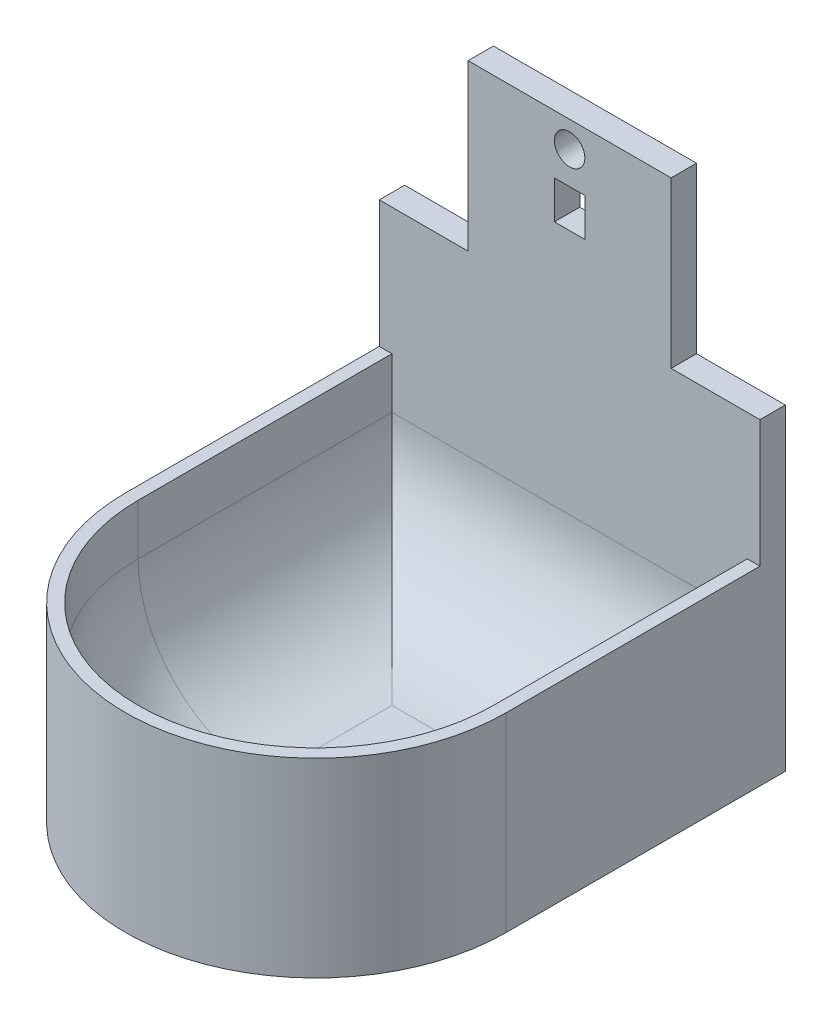
ISO-10303-21;
HEADER;
FILE_DESCRIPTION(('STEP AP214'),'2;1');
FILE_NAME('part.step','',(''),(''),'','','');
FILE_SCHEMA(('AUTOMOTIVE_DESIGN { 1 0 10303 214 1 1 1 1 }'));
ENDSEC;
DATA;
#1=APPLICATION_CONTEXT('core data for automotive mechanical design processes');
#2=APPLICATION_PROTOCOL_DEFINITION('international standard','automotive_design',2000,#1);
#3=PRODUCT_CONTEXT('',#1,'mechanical');
#4=PRODUCT('Part','Part','',(#3));
#5=PRODUCT_RELATED_PRODUCT_CATEGORY('part','',(#4));
#6=PRODUCT_DEFINITION_FORMATION('','',#4);
#7=PRODUCT_DEFINITION_CONTEXT('part definition',#1,'design');
#8=PRODUCT_DEFINITION('design','',#6,#7);
#9=PRODUCT_DEFINITION_SHAPE('','',#8);
#10=(LENGTH_UNIT() NAMED_UNIT(*) SI_UNIT(.MILLI.,.METRE.));
#11=(NAMED_UNIT(*) PLANE_ANGLE_UNIT() SI_UNIT($,.RADIAN.));
#12=(NAMED_UNIT(*) SI_UNIT($,.STERADIAN.) SOLID_ANGLE_UNIT());
#13=UNCERTAINTY_MEASURE_WITH_UNIT(LENGTH_MEASURE(1.E-05),#10,'distance_accuracy_value','');
#14=(GEOMETRIC_REPRESENTATION_CONTEXT(3) GLOBAL_UNCERTAINTY_ASSIGNED_CONTEXT((#13)) GLOBAL_UNIT_ASSIGNED_CONTEXT((#10,
#11,#12)) REPRESENTATION_CONTEXT('',''));
#15=CARTESIAN_POINT('',(0.,0.,0.));
#16=DIRECTION('',(0.,0.,1.));
#17=DIRECTION('',(1.,0.,0.));
#18=AXIS2_PLACEMENT_3D('',#15,#16,#17);
#19=CARTESIAN_POINT('',(19.05,19.05,25.4));
#20=DIRECTION('',(0.,1.,0.));
#21=DIRECTION('',(0.,0.,1.));
#22=AXIS2_PLACEMENT_3D('',#19,#20,#21);
#23=PLANE('',#22);
#24=DIRECTION('',(0.,0.,-1.));
#25=VECTOR('',#24,1.);
#26=CARTESIAN_POINT('',(38.1,19.05,25.4));
#27=LINE('',#26,#25);
#28=CARTESIAN_POINT('',(38.1,19.05,25.4));
#29=VERTEX_POINT('',#28);
#30=CARTESIAN_POINT('',(38.1,19.05,0.));
#31=VERTEX_POINT('',#30);
#32=EDGE_CURVE('E250',#29,#31,#27,.T.);
#33=ORIENTED_EDGE('',*,*,#32,.T.);
#34=DIRECTION('',(-1.,0.,0.));
#35=VECTOR('',#34,1.);
#36=CARTESIAN_POINT('',(0.,19.05,0.));
#37=LINE('',#36,#35);
#38=CARTESIAN_POINT('',(36.83,19.05,0.));
#39=VERTEX_POINT('',#38);
#40=EDGE_CURVE('E227',#31,#39,#37,.T.);
#41=ORIENTED_EDGE('',*,*,#40,.T.);
#42=DIRECTION('',(0.,0.,1.));
#43=VECTOR('',#42,1.);
#44=CARTESIAN_POINT('',(36.83,19.05,0.));
#45=LINE('',#44,#43);
#46=CARTESIAN_POINT('',(36.83,19.05,25.4));
#47=VERTEX_POINT('',#46);
#48=EDGE_CURVE('E252',#39,#47,#45,.T.);
#49=ORIENTED_EDGE('',*,*,#48,.T.);
#50=CARTESIAN_POINT('',(19.05,19.05,25.4));
#51=DIRECTION('',(0.,-1.,0.));
#52=DIRECTION('',(0.,0.,1.));
#53=AXIS2_PLACEMENT_3D('',#50,#51,#52);
#54=CIRCLE('',#53,17.78);
#55=CARTESIAN_POINT('',(1.27000000000001,19.05,25.4));
#56=VERTEX_POINT('',#55);
#57=EDGE_CURVE('E255',#47,#56,#54,.T.);
#58=ORIENTED_EDGE('',*,*,#57,.T.);
#59=DIRECTION('',(0.,0.,-1.));
#60=VECTOR('',#59,1.);
#61=CARTESIAN_POINT('',(1.27,19.05,0.));
#62=LINE('',#61,#60);
#63=CARTESIAN_POINT('',(1.27,19.05,0.));
#64=VERTEX_POINT('',#63);
#65=EDGE_CURVE('E257',#56,#64,#62,.T.);
#66=ORIENTED_EDGE('',*,*,#65,.T.);
#67=CARTESIAN_POINT('',(0.,19.05,0.));
#68=VERTEX_POINT('',#67);
#69=EDGE_CURVE('E11',#64,#68,#37,.T.);
#70=ORIENTED_EDGE('',*,*,#69,.T.);
#71=DIRECTION('',(0.,0.,1.));
#72=VECTOR('',#71,1.);
#73=CARTESIAN_POINT('',(0.,19.05,0.));
#74=LINE('',#73,#72);
#75=CARTESIAN_POINT('',(0.,19.05,25.4));
#76=VERTEX_POINT('',#75);
#77=EDGE_CURVE('E242',#68,#76,#74,.T.);
#78=ORIENTED_EDGE('',*,*,#77,.T.);
#79=CARTESIAN_POINT('',(19.05,19.05,25.4));
#80=DIRECTION('',(0.,1.,0.));
#81=DIRECTION('',(0.,0.,1.));
#82=AXIS2_PLACEMENT_3D('',#79,#80,#81);
#83=CIRCLE('',#82,19.05);
#84=EDGE_CURVE('E245',#76,#29,#83,.T.);
#85=ORIENTED_EDGE('',*,*,#84,.T.);
#86=EDGE_LOOP('',(#33,#41,#49,#58,#66,#70,#78,#85));
#87=FACE_BOUND('',#86,.T.);
#88=ADVANCED_FACE('F32',(#87),#23,.T.);
#89=CARTESIAN_POINT('',(0.,1.27,0.));
#90=DIRECTION('',(1.,0.,0.));
#91=DIRECTION('',(0.,0.,-1.));
#92=AXIS2_PLACEMENT_3D('',#89,#90,#91);
#93=PLANE('',#92);
#94=DIRECTION('',(0.,0.,1.));
#95=VECTOR('',#94,1.);
#96=CARTESIAN_POINT('',(0.,0.,0.));
#97=LINE('',#96,#95);
#98=CARTESIAN_POINT('',(0.,0.,-2.54));
#99=VERTEX_POINT('',#98);
#100=CARTESIAN_POINT('',(0.,0.,25.4));
#101=VERTEX_POINT('',#100);
#102=EDGE_CURVE('E266',#99,#101,#97,.T.);
#103=ORIENTED_EDGE('',*,*,#102,.T.);
#104=DIRECTION('',(0.,-1.,0.));
#105=VECTOR('',#104,1.);
#106=CARTESIAN_POINT('',(0.,1.27,25.4));
#107=LINE('',#106,#105);
#108=EDGE_CURVE('E276',#76,#101,#107,.T.);
#109=ORIENTED_EDGE('',*,*,#108,.F.);
#110=ORIENTED_EDGE('',*,*,#77,.F.);
#111=DIRECTION('',(0.,1.,0.));
#112=VECTOR('',#111,1.);
#113=CARTESIAN_POINT('',(0.,31.75,0.));
#114=LINE('',#113,#112);
#115=CARTESIAN_POINT('',(0.,31.75,0.));
#116=VERTEX_POINT('',#115);
#117=EDGE_CURVE('E230',#68,#116,#114,.T.);
#118=ORIENTED_EDGE('',*,*,#117,.T.);
#119=DIRECTION('',(0.,0.,-1.));
#120=VECTOR('',#119,1.);
#121=CARTESIAN_POINT('',(0.,31.75,0.));
#122=LINE('',#121,#120);
#123=CARTESIAN_POINT('',(0.,31.75,-2.54));
#124=VERTEX_POINT('',#123);
#125=EDGE_CURVE('E626',#116,#124,#122,.T.);
#126=ORIENTED_EDGE('',*,*,#125,.T.);
#127=DIRECTION('',(0.,1.,0.));
#128=VECTOR('',#127,1.);
#129=CARTESIAN_POINT('',(0.,19.05,-2.54));
#130=LINE('',#129,#128);
#131=EDGE_CURVE('E240',#99,#124,#130,.T.);
#132=ORIENTED_EDGE('',*,*,#131,.F.);
#133=EDGE_LOOP('',(#103,#109,#110,#118,#126,#132));
#134=FACE_BOUND('',#133,.T.);
#135=ADVANCED_FACE('F372',(#134),#93,.F.);
#136=CARTESIAN_POINT('',(19.05,1.27,25.4));
#137=DIRECTION('',(0.,-1.,0.));
#138=DIRECTION('',(0.,0.,-1.));
#139=AXIS2_PLACEMENT_3D('',#136,#137,#138);
#140=CYLINDRICAL_SURFACE('',#139,19.05);
#141=CARTESIAN_POINT('',(19.05,0.,25.4));
#142=DIRECTION('',(0.,1.,0.));
#143=DIRECTION('',(0.,0.,1.));
#144=AXIS2_PLACEMENT_3D('',#141,#142,#143);
#145=CIRCLE('',#144,19.05);
#146=CARTESIAN_POINT('',(38.1,0.,25.4));
#147=VERTEX_POINT('',#146);
#148=EDGE_CURVE('E269',#101,#147,#145,.T.);
#149=ORIENTED_EDGE('',*,*,#148,.T.);
#150=DIRECTION('',(0.,-1.,0.));
#151=VECTOR('',#150,1.);
#152=CARTESIAN_POINT('',(38.1,1.27,25.4));
#153=LINE('',#152,#151);
#154=EDGE_CURVE('E273',#29,#147,#153,.T.);
#155=ORIENTED_EDGE('',*,*,#154,.F.);
#156=ORIENTED_EDGE('',*,*,#84,.F.);
#157=ORIENTED_EDGE('',*,*,#108,.T.);
#158=EDGE_LOOP('',(#149,#155,#156,#157));
#159=FACE_BOUND('',#158,.T.);
#160=ADVANCED_FACE('F367',(#159),#140,.T.);
#161=CARTESIAN_POINT('',(38.1,1.27,0.));
#162=DIRECTION('',(-1.,0.,0.));
#163=DIRECTION('',(0.,0.,1.));
#164=AXIS2_PLACEMENT_3D('',#161,#162,#163);
#165=PLANE('',#164);
#166=DIRECTION('',(0.,0.,-1.));
#167=VECTOR('',#166,1.);
#168=CARTESIAN_POINT('',(38.1,0.,0.));
#169=LINE('',#168,#167);
#170=CARTESIAN_POINT('',(38.1,0.,-2.54));
#171=VERTEX_POINT('',#170);
#172=EDGE_CURVE('E271',#147,#171,#169,.T.);
#173=ORIENTED_EDGE('',*,*,#172,.T.);
#174=DIRECTION('',(0.,-1.,0.));
#175=VECTOR('',#174,1.);
#176=CARTESIAN_POINT('',(38.1,19.05,-2.54));
#177=LINE('',#176,#175);
#178=CARTESIAN_POINT('',(38.1,31.75,-2.54));
#179=VERTEX_POINT('',#178);
#180=EDGE_CURVE('E233',#179,#171,#177,.T.);
#181=ORIENTED_EDGE('',*,*,#180,.F.);
#182=DIRECTION('',(0.,0.,-1.));
#183=VECTOR('',#182,1.);
#184=CARTESIAN_POINT('',(38.1,31.75,0.));
#185=LINE('',#184,#183);
#186=CARTESIAN_POINT('',(38.1,31.75,0.));
#187=VERTEX_POINT('',#186);
#188=EDGE_CURVE('E231',#187,#179,#185,.T.);
#189=ORIENTED_EDGE('',*,*,#188,.F.);
#190=DIRECTION('',(0.,-1.,0.));
#191=VECTOR('',#190,1.);
#192=CARTESIAN_POINT('',(38.1,19.05,0.));
#193=LINE('',#192,#191);
#194=EDGE_CURVE('E217',#187,#31,#193,.T.);
#195=ORIENTED_EDGE('',*,*,#194,.T.);
#196=ORIENTED_EDGE('',*,*,#32,.F.);
#197=ORIENTED_EDGE('',*,*,#154,.T.);
#198=EDGE_LOOP('',(#173,#181,#189,#195,#196,#197));
#199=FACE_BOUND('',#198,.T.);
#200=ADVANCED_FACE('F359',(#199),#165,.F.);
#201=CARTESIAN_POINT('',(19.05,1.27,25.4));
#202=DIRECTION('',(0.,1.,0.));
#203=DIRECTION('',(0.,0.,1.));
#204=AXIS2_PLACEMENT_3D('',#201,#202,#203);
#205=PLANE('',#204);
#206=DIRECTION('',(0.,0.,1.));
#207=VECTOR('',#206,1.);
#208=CARTESIAN_POINT('',(24.13,1.27,25.4));
#209=LINE('',#208,#207);
#210=CARTESIAN_POINT('',(24.13,1.27,25.4));
#211=VERTEX_POINT('',#210);
#212=CARTESIAN_POINT('',(24.13,1.27,12.7));
#213=VERTEX_POINT('',#212);
#214=EDGE_CURVE('E298',#211,#213,#209,.F.);
#215=ORIENTED_EDGE('',*,*,#214,.T.);
#216=DIRECTION('',(-1.,0.,0.));
#217=VECTOR('',#216,1.);
#218=CARTESIAN_POINT('',(19.05,1.27,12.7));
#219=LINE('',#218,#217);
#220=CARTESIAN_POINT('',(13.97,1.27,12.7));
#221=VERTEX_POINT('',#220);
#222=EDGE_CURVE('E300',#213,#221,#219,.T.);
#223=ORIENTED_EDGE('',*,*,#222,.T.);
#224=DIRECTION('',(0.,0.,-1.));
#225=VECTOR('',#224,1.);
#226=CARTESIAN_POINT('',(13.97,1.27,25.4));
#227=LINE('',#226,#225);
#228=CARTESIAN_POINT('',(13.97,1.27,25.4));
#229=VERTEX_POINT('',#228);
#230=EDGE_CURVE('E279',#221,#229,#227,.F.);
#231=ORIENTED_EDGE('',*,*,#230,.T.);
#232=CARTESIAN_POINT('',(19.05,1.27,25.4));
#233=DIRECTION('',(0.,1.,0.));
#234=DIRECTION('',(0.,0.,1.));
#235=AXIS2_PLACEMENT_3D('',#232,#233,#234);
#236=CIRCLE('',#235,5.08);
#237=EDGE_CURVE('E296',#229,#211,#236,.T.);
#238=ORIENTED_EDGE('',*,*,#237,.T.);
#239=EDGE_LOOP('',(#215,#223,#231,#238));
#240=FACE_BOUND('',#239,.T.);
#241=ADVANCED_FACE('F356',(#240),#205,.T.);
#242=CARTESIAN_POINT('',(19.05,0.,25.4));
#243=DIRECTION('',(0.,1.,0.));
#244=DIRECTION('',(0.,0.,1.));
#245=AXIS2_PLACEMENT_3D('',#242,#243,#244);
#246=PLANE('',#245);
#247=ORIENTED_EDGE('',*,*,#102,.F.);
#248=DIRECTION('',(-1.,0.,0.));
#249=VECTOR('',#248,1.);
#250=CARTESIAN_POINT('',(38.1,0.,-2.54));
#251=LINE('',#250,#249);
#252=EDGE_CURVE('E236',#171,#99,#251,.T.);
#253=ORIENTED_EDGE('',*,*,#252,.F.);
#254=ORIENTED_EDGE('',*,*,#172,.F.);
#255=ORIENTED_EDGE('',*,*,#148,.F.);
#256=EDGE_LOOP('',(#247,#253,#254,#255));
#257=FACE_BOUND('',#256,.T.);
#258=ADVANCED_FACE('F358',(#257),#246,.F.);
#259=CARTESIAN_POINT('',(36.83,19.05,0.));
#260=DIRECTION('',(1.,0.,0.));
#261=DIRECTION('',(0.,0.,-1.));
#262=AXIS2_PLACEMENT_3D('',#259,#260,#261);
#263=PLANE('',#262);
#264=DIRECTION('',(0.,-1.,0.));
#265=VECTOR('',#264,1.);
#266=CARTESIAN_POINT('',(36.83,19.05,0.));
#267=LINE('',#266,#265);
#268=CARTESIAN_POINT('',(36.83,13.97,0.));
#269=VERTEX_POINT('',#268);
#270=EDGE_CURVE('E265',#39,#269,#267,.T.);
#271=ORIENTED_EDGE('',*,*,#270,.T.);
#272=DIRECTION('',(0.,0.,1.));
#273=VECTOR('',#272,1.);
#274=CARTESIAN_POINT('',(36.83,13.97,0.));
#275=LINE('',#274,#273);
#276=CARTESIAN_POINT('',(36.83,13.97,25.4));
#277=VERTEX_POINT('',#276);
#278=EDGE_CURVE('E306',#269,#277,#275,.T.);
#279=ORIENTED_EDGE('',*,*,#278,.T.);
#280=DIRECTION('',(0.,-1.,0.));
#281=VECTOR('',#280,1.);
#282=CARTESIAN_POINT('',(36.83,19.05,25.4));
#283=LINE('',#282,#281);
#284=EDGE_CURVE('E261',#47,#277,#283,.T.);
#285=ORIENTED_EDGE('',*,*,#284,.F.);
#286=ORIENTED_EDGE('',*,*,#48,.F.);
#287=EDGE_LOOP('',(#271,#279,#285,#286));
#288=FACE_BOUND('',#287,.T.);
#289=ADVANCED_FACE('F345',(#288),#263,.F.);
#290=CARTESIAN_POINT('',(19.05,19.05,25.4));
#291=DIRECTION('',(0.,-1.,0.));
#292=DIRECTION('',(0.,0.,-1.));
#293=AXIS2_PLACEMENT_3D('',#290,#291,#292);
#294=CYLINDRICAL_SURFACE('',#293,17.78);
#295=ORIENTED_EDGE('',*,*,#284,.T.);
#296=CARTESIAN_POINT('',(19.05,13.97,25.4));
#297=DIRECTION('',(0.,1.,0.));
#298=DIRECTION('',(0.,0.,1.));
#299=AXIS2_PLACEMENT_3D('',#296,#297,#298);
#300=CIRCLE('',#299,17.78);
#301=CARTESIAN_POINT('',(1.27000000000001,13.97,25.4));
#302=VERTEX_POINT('',#301);
#303=EDGE_CURVE('E308',#277,#302,#300,.F.);
#304=ORIENTED_EDGE('',*,*,#303,.T.);
#305=DIRECTION('',(0.,-1.,0.));
#306=VECTOR('',#305,1.);
#307=CARTESIAN_POINT('',(1.27000000000001,19.05,25.4));
#308=LINE('',#307,#306);
#309=EDGE_CURVE('E258',#56,#302,#308,.T.);
#310=ORIENTED_EDGE('',*,*,#309,.F.);
#311=ORIENTED_EDGE('',*,*,#57,.F.);
#312=EDGE_LOOP('',(#295,#304,#310,#311));
#313=FACE_BOUND('',#312,.T.);
#314=ADVANCED_FACE('F333',(#313),#294,.F.);
#315=CARTESIAN_POINT('',(1.27,19.05,0.));
#316=DIRECTION('',(-1.,0.,0.));
#317=DIRECTION('',(0.,0.,1.));
#318=AXIS2_PLACEMENT_3D('',#315,#316,#317);
#319=PLANE('',#318);
#320=ORIENTED_EDGE('',*,*,#309,.T.);
#321=DIRECTION('',(0.,0.,-1.));
#322=VECTOR('',#321,1.);
#323=CARTESIAN_POINT('',(1.27,13.97,0.));
#324=LINE('',#323,#322);
#325=CARTESIAN_POINT('',(1.27,13.97,0.));
#326=VERTEX_POINT('',#325);
#327=EDGE_CURVE('E41',#302,#326,#324,.T.);
#328=ORIENTED_EDGE('',*,*,#327,.T.);
#329=DIRECTION('',(0.,-1.,0.));
#330=VECTOR('',#329,1.);
#331=CARTESIAN_POINT('',(1.27,19.05,0.));
#332=LINE('',#331,#330);
#333=EDGE_CURVE('E262',#64,#326,#332,.T.);
#334=ORIENTED_EDGE('',*,*,#333,.F.);
#335=ORIENTED_EDGE('',*,*,#65,.F.);
#336=EDGE_LOOP('',(#320,#328,#334,#335));
#337=FACE_BOUND('',#336,.T.);
#338=ADVANCED_FACE('F338',(#337),#319,.F.);
#339=CARTESIAN_POINT('',(0.,0.,0.));
#340=DIRECTION('',(0.,0.,-1.));
#341=DIRECTION('',(-1.,0.,0.));
#342=AXIS2_PLACEMENT_3D('',#339,#340,#341);
#343=PLANE('',#342);
#344=DIRECTION('',(-1.,0.,0.));
#345=VECTOR('',#344,1.);
#346=CARTESIAN_POINT('',(20.574,42.418,0.));
#347=LINE('',#346,#345);
#348=CARTESIAN_POINT('',(20.574,42.418,0.));
#349=VERTEX_POINT('',#348);
#350=CARTESIAN_POINT('',(17.526,42.418,0.));
#351=VERTEX_POINT('',#350);
#352=EDGE_CURVE('E191',#349,#351,#347,.T.);
#353=ORIENTED_EDGE('',*,*,#352,.F.);
#354=DIRECTION('',(0.,1.,0.));
#355=VECTOR('',#354,1.);
#356=CARTESIAN_POINT('',(20.574,42.418,0.));
#357=LINE('',#356,#355);
#358=CARTESIAN_POINT('',(20.574,38.608,0.));
#359=VERTEX_POINT('',#358);
#360=EDGE_CURVE('E173',#359,#349,#357,.T.);
#361=ORIENTED_EDGE('',*,*,#360,.F.);
#362=DIRECTION('',(1.,0.,0.));
#363=VECTOR('',#362,1.);
#364=CARTESIAN_POINT('',(20.574,38.608,0.));
#365=LINE('',#364,#363);
#366=CARTESIAN_POINT('',(17.526,38.608,0.));
#367=VERTEX_POINT('',#366);
#368=EDGE_CURVE('E182',#367,#359,#365,.T.);
#369=ORIENTED_EDGE('',*,*,#368,.F.);
#370=DIRECTION('',(0.,-1.,0.));
#371=VECTOR('',#370,1.);
#372=CARTESIAN_POINT('',(17.526,42.418,0.));
#373=LINE('',#372,#371);
#374=EDGE_CURVE('E49',#351,#367,#373,.T.);
#375=ORIENTED_EDGE('',*,*,#374,.F.);
#376=EDGE_LOOP('',(#353,#361,#369,#375));
#377=FACE_BOUND('',#376,.T.);
#378=CARTESIAN_POINT('',(19.05,45.6565,0.));
#379=DIRECTION('',(0.,0.,-1.));
#380=DIRECTION('',(-1.,0.,0.));
#381=AXIS2_PLACEMENT_3D('',#378,#379,#380);
#382=CIRCLE('',#381,1.524);
#383=CARTESIAN_POINT('',(17.526,45.6565,0.));
#384=VERTEX_POINT('',#383);
#385=EDGE_CURVE('E210',#384,#384,#382,.F.);
#386=ORIENTED_EDGE('',*,*,#385,.F.);
#387=EDGE_LOOP('',(#386));
#388=FACE_BOUND('',#387,.T.);
#389=ORIENTED_EDGE('',*,*,#333,.T.);
#390=DIRECTION('',(-1.,0.,0.));
#391=VECTOR('',#390,1.);
#392=CARTESIAN_POINT('',(0.,13.97,0.));
#393=LINE('',#392,#391);
#394=EDGE_CURVE('E303',#326,#269,#393,.F.);
#395=ORIENTED_EDGE('',*,*,#394,.T.);
#396=ORIENTED_EDGE('',*,*,#270,.F.);
#397=ORIENTED_EDGE('',*,*,#40,.F.);
#398=ORIENTED_EDGE('',*,*,#194,.F.);
#399=DIRECTION('',(1.,0.,0.));
#400=VECTOR('',#399,1.);
#401=CARTESIAN_POINT('',(38.1,31.75,0.));
#402=LINE('',#401,#400);
#403=CARTESIAN_POINT('',(29.21,31.75,0.));
#404=VERTEX_POINT('',#403);
#405=EDGE_CURVE('E214',#404,#187,#402,.T.);
#406=ORIENTED_EDGE('',*,*,#405,.F.);
#407=DIRECTION('',(0.,-1.,0.));
#408=VECTOR('',#407,1.);
#409=CARTESIAN_POINT('',(29.21,31.75,0.));
#410=LINE('',#409,#408);
#411=CARTESIAN_POINT('',(29.21,48.26,0.));
#412=VERTEX_POINT('',#411);
#413=EDGE_CURVE('E627',#412,#404,#410,.T.);
#414=ORIENTED_EDGE('',*,*,#413,.F.);
#415=DIRECTION('',(1.,0.,0.));
#416=VECTOR('',#415,1.);
#417=CARTESIAN_POINT('',(29.21,48.26,0.));
#418=LINE('',#417,#416);
#419=CARTESIAN_POINT('',(8.88999999999999,48.26,0.));
#420=VERTEX_POINT('',#419);
#421=EDGE_CURVE('E631',#420,#412,#418,.T.);
#422=ORIENTED_EDGE('',*,*,#421,.F.);
#423=DIRECTION('',(0.,1.,0.));
#424=VECTOR('',#423,1.);
#425=CARTESIAN_POINT('',(8.88999999999999,48.26,0.));
#426=LINE('',#425,#424);
#427=CARTESIAN_POINT('',(8.88999999999999,31.75,0.));
#428=VERTEX_POINT('',#427);
#429=EDGE_CURVE('E635',#428,#420,#426,.T.);
#430=ORIENTED_EDGE('',*,*,#429,.F.);
#431=DIRECTION('',(1.,0.,0.));
#432=VECTOR('',#431,1.);
#433=CARTESIAN_POINT('',(8.88999999999999,31.75,0.));
#434=LINE('',#433,#432);
#435=EDGE_CURVE('E221',#116,#428,#434,.T.);
#436=ORIENTED_EDGE('',*,*,#435,.F.);
#437=ORIENTED_EDGE('',*,*,#117,.F.);
#438=ORIENTED_EDGE('',*,*,#69,.F.);
#439=EDGE_LOOP('',(#389,#395,#396,#397,#398,#406,#414,#422,#430,#436,#437,#438));
#440=FACE_BOUND('',#439,.T.);
#441=ADVANCED_FACE('F188',(#377,#388,#440),#343,.F.);
#442=CARTESIAN_POINT('',(0.,0.,-2.54));
#443=DIRECTION('',(0.,0.,-1.));
#444=DIRECTION('',(-1.,0.,0.));
#445=AXIS2_PLACEMENT_3D('',#442,#443,#444);
#446=PLANE('',#445);
#447=DIRECTION('',(0.,-1.,0.));
#448=VECTOR('',#447,1.);
#449=CARTESIAN_POINT('',(20.574,42.418,-2.54));
#450=LINE('',#449,#448);
#451=CARTESIAN_POINT('',(20.574,42.418,-2.54));
#452=VERTEX_POINT('',#451);
#453=CARTESIAN_POINT('',(20.574,38.608,-2.54));
#454=VERTEX_POINT('',#453);
#455=EDGE_CURVE('E57',#452,#454,#450,.T.);
#456=ORIENTED_EDGE('',*,*,#455,.F.);
#457=DIRECTION('',(1.,0.,0.));
#458=VECTOR('',#457,1.);
#459=CARTESIAN_POINT('',(20.574,42.418,-2.54));
#460=LINE('',#459,#458);
#461=CARTESIAN_POINT('',(17.526,42.418,-2.54));
#462=VERTEX_POINT('',#461);
#463=EDGE_CURVE('E179',#462,#452,#460,.T.);
#464=ORIENTED_EDGE('',*,*,#463,.F.);
#465=DIRECTION('',(0.,1.,0.));
#466=VECTOR('',#465,1.);
#467=CARTESIAN_POINT('',(17.526,42.418,-2.54));
#468=LINE('',#467,#466);
#469=CARTESIAN_POINT('',(17.526,38.608,-2.54));
#470=VERTEX_POINT('',#469);
#471=EDGE_CURVE('E199',#470,#462,#468,.T.);
#472=ORIENTED_EDGE('',*,*,#471,.F.);
#473=DIRECTION('',(-1.,0.,0.));
#474=VECTOR('',#473,1.);
#475=CARTESIAN_POINT('',(20.574,38.608,-2.54));
#476=LINE('',#475,#474);
#477=EDGE_CURVE('E193',#454,#470,#476,.T.);
#478=ORIENTED_EDGE('',*,*,#477,.F.);
#479=EDGE_LOOP('',(#456,#464,#472,#478));
#480=FACE_BOUND('',#479,.T.);
#481=CARTESIAN_POINT('',(19.05,45.6565,-2.54));
#482=DIRECTION('',(0.,0.,-1.));
#483=DIRECTION('',(-1.,0.,0.));
#484=AXIS2_PLACEMENT_3D('',#481,#482,#483);
#485=CIRCLE('',#484,1.524);
#486=CARTESIAN_POINT('',(17.526,45.6565,-2.54));
#487=VERTEX_POINT('',#486);
#488=EDGE_CURVE('E185',#487,#487,#485,.T.);
#489=ORIENTED_EDGE('',*,*,#488,.F.);
#490=EDGE_LOOP('',(#489));
#491=FACE_BOUND('',#490,.T.);
#492=ORIENTED_EDGE('',*,*,#180,.T.);
#493=ORIENTED_EDGE('',*,*,#252,.T.);
#494=ORIENTED_EDGE('',*,*,#131,.T.);
#495=DIRECTION('',(1.,0.,0.));
#496=VECTOR('',#495,1.);
#497=CARTESIAN_POINT('',(8.88999999999999,31.75,-2.54));
#498=LINE('',#497,#496);
#499=CARTESIAN_POINT('',(8.88999999999999,31.75,-2.54));
#500=VERTEX_POINT('',#499);
#501=EDGE_CURVE('E639',#124,#500,#498,.T.);
#502=ORIENTED_EDGE('',*,*,#501,.T.);
#503=DIRECTION('',(0.,1.,0.));
#504=VECTOR('',#503,1.);
#505=CARTESIAN_POINT('',(8.88999999999999,48.26,-2.54));
#506=LINE('',#505,#504);
#507=CARTESIAN_POINT('',(8.88999999999999,48.26,-2.54));
#508=VERTEX_POINT('',#507);
#509=EDGE_CURVE('E642',#500,#508,#506,.T.);
#510=ORIENTED_EDGE('',*,*,#509,.T.);
#511=DIRECTION('',(1.,0.,0.));
#512=VECTOR('',#511,1.);
#513=CARTESIAN_POINT('',(29.21,48.26,-2.54));
#514=LINE('',#513,#512);
#515=CARTESIAN_POINT('',(29.21,48.26,-2.54));
#516=VERTEX_POINT('',#515);
#517=EDGE_CURVE('E645',#508,#516,#514,.T.);
#518=ORIENTED_EDGE('',*,*,#517,.T.);
#519=DIRECTION('',(0.,-1.,0.));
#520=VECTOR('',#519,1.);
#521=CARTESIAN_POINT('',(29.21,31.75,-2.54));
#522=LINE('',#521,#520);
#523=CARTESIAN_POINT('',(29.21,31.75,-2.54));
#524=VERTEX_POINT('',#523);
#525=EDGE_CURVE('E218',#516,#524,#522,.T.);
#526=ORIENTED_EDGE('',*,*,#525,.T.);
#527=DIRECTION('',(1.,0.,0.));
#528=VECTOR('',#527,1.);
#529=CARTESIAN_POINT('',(38.1,31.75,-2.54));
#530=LINE('',#529,#528);
#531=EDGE_CURVE('E213',#524,#179,#530,.T.);
#532=ORIENTED_EDGE('',*,*,#531,.T.);
#533=EDGE_LOOP('',(#492,#493,#494,#502,#510,#518,#526,#532));
#534=FACE_BOUND('',#533,.T.);
#535=ADVANCED_FACE('F407',(#480,#491,#534),#446,.T.);
#536=CARTESIAN_POINT('',(19.05,13.97,25.4));
#537=DIRECTION('',(0.,1.,0.));
#538=DIRECTION('',(0.,0.,1.));
#539=AXIS2_PLACEMENT_3D('',#536,#537,#538);
#540=DEGENERATE_TOROIDAL_SURFACE('',#539,5.08,12.7,.T.);
#541=CARTESIAN_POINT('',(13.97,13.97,25.4));
#542=DIRECTION('',(0.,0.,1.));
#543=DIRECTION('',(1.,0.,0.));
#544=AXIS2_PLACEMENT_3D('',#541,#542,#543);
#545=CIRCLE('',#544,12.7);
#546=EDGE_CURVE('E315',#302,#229,#545,.T.);
#547=ORIENTED_EDGE('',*,*,#546,.F.);
#548=ORIENTED_EDGE('',*,*,#303,.F.);
#549=CARTESIAN_POINT('',(24.13,13.97,25.4));
#550=DIRECTION('',(0.,0.,1.));
#551=DIRECTION('',(1.,0.,0.));
#552=AXIS2_PLACEMENT_3D('',#549,#550,#551);
#553=CIRCLE('',#552,12.7);
#554=EDGE_CURVE('E237',#211,#277,#553,.T.);
#555=ORIENTED_EDGE('',*,*,#554,.F.);
#556=ORIENTED_EDGE('',*,*,#237,.F.);
#557=EDGE_LOOP('',(#547,#548,#555,#556));
#558=FACE_BOUND('',#557,.T.);
#559=ADVANCED_FACE('F34',(#558),#540,.F.);
#560=CARTESIAN_POINT('',(24.13,13.97,0.));
#561=DIRECTION('',(0.,0.,1.));
#562=DIRECTION('',(1.,0.,0.));
#563=AXIS2_PLACEMENT_3D('',#560,#561,#562);
#564=CYLINDRICAL_SURFACE('',#563,12.7);
#565=ORIENTED_EDGE('',*,*,#554,.T.);
#566=ORIENTED_EDGE('',*,*,#278,.F.);
#567=CARTESIAN_POINT('',(24.13,13.97,12.7));
#568=DIRECTION('',(-0.707106781186547,0.,-0.707106781186547));
#569=DIRECTION('',(-0.707106781186547,0.,0.707106781186547));
#570=AXIS2_PLACEMENT_3D('',#567,#568,#569);
#571=ELLIPSE('',#570,17.9605122421383,12.7);
#572=EDGE_CURVE('E313',#213,#269,#571,.F.);
#573=ORIENTED_EDGE('',*,*,#572,.F.);
#574=ORIENTED_EDGE('',*,*,#214,.F.);
#575=EDGE_LOOP('',(#565,#566,#573,#574));
#576=FACE_BOUND('',#575,.T.);
#577=ADVANCED_FACE('F326',(#576),#564,.F.);
#578=CARTESIAN_POINT('',(13.97,13.97,0.));
#579=DIRECTION('',(0.,0.,-1.));
#580=DIRECTION('',(-1.,0.,0.));
#581=AXIS2_PLACEMENT_3D('',#578,#579,#580);
#582=CYLINDRICAL_SURFACE('',#581,12.7);
#583=ORIENTED_EDGE('',*,*,#546,.T.);
#584=ORIENTED_EDGE('',*,*,#230,.F.);
#585=CARTESIAN_POINT('',(13.97,13.97,12.7));
#586=DIRECTION('',(-0.707106781186547,0.,0.707106781186548));
#587=DIRECTION('',(-0.707106781186548,0.,-0.707106781186547));
#588=AXIS2_PLACEMENT_3D('',#585,#586,#587);
#589=ELLIPSE('',#588,17.9605122421383,12.7);
#590=EDGE_CURVE('E311',#326,#221,#589,.T.);
#591=ORIENTED_EDGE('',*,*,#590,.F.);
#592=ORIENTED_EDGE('',*,*,#327,.F.);
#593=EDGE_LOOP('',(#583,#584,#591,#592));
#594=FACE_BOUND('',#593,.T.);
#595=ADVANCED_FACE('F354',(#594),#582,.F.);
#596=CARTESIAN_POINT('',(19.05,13.97,12.7));
#597=DIRECTION('',(-1.,0.,0.));
#598=DIRECTION('',(0.,0.,1.));
#599=AXIS2_PLACEMENT_3D('',#596,#597,#598);
#600=CYLINDRICAL_SURFACE('',#599,12.7);
#601=ORIENTED_EDGE('',*,*,#572,.T.);
#602=ORIENTED_EDGE('',*,*,#394,.F.);
#603=ORIENTED_EDGE('',*,*,#590,.T.);
#604=ORIENTED_EDGE('',*,*,#222,.F.);
#605=EDGE_LOOP('',(#601,#602,#603,#604));
#606=FACE_BOUND('',#605,.T.);
#607=ADVANCED_FACE('F352',(#606),#600,.F.);
#608=CARTESIAN_POINT('',(38.1,31.75,0.));
#609=DIRECTION('',(0.,1.,0.));
#610=DIRECTION('',(0.,0.,1.));
#611=AXIS2_PLACEMENT_3D('',#608,#609,#610);
#612=PLANE('',#611);
#613=ORIENTED_EDGE('',*,*,#531,.F.);
#614=DIRECTION('',(0.,0.,-1.));
#615=VECTOR('',#614,1.);
#616=CARTESIAN_POINT('',(29.21,31.75,0.));
#617=LINE('',#616,#615);
#618=EDGE_CURVE('E314',#404,#524,#617,.T.);
#619=ORIENTED_EDGE('',*,*,#618,.F.);
#620=ORIENTED_EDGE('',*,*,#405,.T.);
#621=ORIENTED_EDGE('',*,*,#188,.T.);
#622=EDGE_LOOP('',(#613,#619,#620,#621));
#623=FACE_BOUND('',#622,.T.);
#624=ADVANCED_FACE('F436',(#623),#612,.T.);
#625=CARTESIAN_POINT('',(29.21,31.75,0.));
#626=DIRECTION('',(1.,0.,0.));
#627=DIRECTION('',(0.,1.,0.));
#628=AXIS2_PLACEMENT_3D('',#625,#626,#627);
#629=PLANE('',#628);
#630=ORIENTED_EDGE('',*,*,#525,.F.);
#631=DIRECTION('',(0.,0.,-1.));
#632=VECTOR('',#631,1.);
#633=CARTESIAN_POINT('',(29.21,48.26,0.));
#634=LINE('',#633,#632);
#635=EDGE_CURVE('E650',#412,#516,#634,.T.);
#636=ORIENTED_EDGE('',*,*,#635,.F.);
#637=ORIENTED_EDGE('',*,*,#413,.T.);
#638=ORIENTED_EDGE('',*,*,#618,.T.);
#639=EDGE_LOOP('',(#630,#636,#637,#638));
#640=FACE_BOUND('',#639,.T.);
#641=ADVANCED_FACE('F442',(#640),#629,.T.);
#642=CARTESIAN_POINT('',(29.21,48.26,0.));
#643=DIRECTION('',(0.,1.,0.));
#644=DIRECTION('',(0.,0.,1.));
#645=AXIS2_PLACEMENT_3D('',#642,#643,#644);
#646=PLANE('',#645);
#647=ORIENTED_EDGE('',*,*,#517,.F.);
#648=DIRECTION('',(0.,0.,-1.));
#649=VECTOR('',#648,1.);
#650=CARTESIAN_POINT('',(8.88999999999999,48.26,0.));
#651=LINE('',#650,#649);
#652=EDGE_CURVE('E652',#420,#508,#651,.T.);
#653=ORIENTED_EDGE('',*,*,#652,.F.);
#654=ORIENTED_EDGE('',*,*,#421,.T.);
#655=ORIENTED_EDGE('',*,*,#635,.T.);
#656=EDGE_LOOP('',(#647,#653,#654,#655));
#657=FACE_BOUND('',#656,.T.);
#658=ADVANCED_FACE('F450',(#657),#646,.T.);
#659=CARTESIAN_POINT('',(8.88999999999999,48.26,0.));
#660=DIRECTION('',(-1.,0.,0.));
#661=DIRECTION('',(0.,0.,1.));
#662=AXIS2_PLACEMENT_3D('',#659,#660,#661);
#663=PLANE('',#662);
#664=ORIENTED_EDGE('',*,*,#509,.F.);
#665=DIRECTION('',(0.,0.,-1.));
#666=VECTOR('',#665,1.);
#667=CARTESIAN_POINT('',(8.88999999999999,31.75,0.));
#668=LINE('',#667,#666);
#669=EDGE_CURVE('E629',#428,#500,#668,.T.);
#670=ORIENTED_EDGE('',*,*,#669,.F.);
#671=ORIENTED_EDGE('',*,*,#429,.T.);
#672=ORIENTED_EDGE('',*,*,#652,.T.);
#673=EDGE_LOOP('',(#664,#670,#671,#672));
#674=FACE_BOUND('',#673,.T.);
#675=ADVANCED_FACE('F458',(#674),#663,.T.);
#676=CARTESIAN_POINT('',(8.88999999999999,31.75,0.));
#677=DIRECTION('',(0.,1.,0.));
#678=DIRECTION('',(-1.,0.,0.));
#679=AXIS2_PLACEMENT_3D('',#676,#677,#678);
#680=PLANE('',#679);
#681=ORIENTED_EDGE('',*,*,#501,.F.);
#682=ORIENTED_EDGE('',*,*,#125,.F.);
#683=ORIENTED_EDGE('',*,*,#435,.T.);
#684=ORIENTED_EDGE('',*,*,#669,.T.);
#685=EDGE_LOOP('',(#681,#682,#683,#684));
#686=FACE_BOUND('',#685,.T.);
#687=ADVANCED_FACE('F466',(#686),#680,.T.);
#688=CARTESIAN_POINT('',(19.05,45.6565,44.451));
#689=DIRECTION('',(0.,0.,-1.));
#690=DIRECTION('',(-1.,0.,0.));
#691=AXIS2_PLACEMENT_3D('',#688,#689,#690);
#692=CYLINDRICAL_SURFACE('',#691,1.524);
#693=ORIENTED_EDGE('',*,*,#488,.T.);
#694=EDGE_LOOP('',(#693));
#695=FACE_BOUND('',#694,.T.);
#696=ORIENTED_EDGE('',*,*,#385,.T.);
#697=EDGE_LOOP('',(#696));
#698=FACE_BOUND('',#697,.T.);
#699=ADVANCED_FACE('F473',(#695,#698),#692,.F.);
#700=CARTESIAN_POINT('',(20.574,42.418,44.451));
#701=DIRECTION('',(1.,0.,0.));
#702=DIRECTION('',(0.,0.,-1.));
#703=AXIS2_PLACEMENT_3D('',#700,#701,#702);
#704=PLANE('',#703);
#705=ORIENTED_EDGE('',*,*,#360,.T.);
#706=DIRECTION('',(0.,0.,-1.));
#707=VECTOR('',#706,1.);
#708=CARTESIAN_POINT('',(20.574,42.418,44.451));
#709=LINE('',#708,#707);
#710=EDGE_CURVE('E186',#349,#452,#709,.T.);
#711=ORIENTED_EDGE('',*,*,#710,.T.);
#712=ORIENTED_EDGE('',*,*,#455,.T.);
#713=DIRECTION('',(0.,0.,-1.));
#714=VECTOR('',#713,1.);
#715=CARTESIAN_POINT('',(20.574,38.608,44.451));
#716=LINE('',#715,#714);
#717=EDGE_CURVE('E169',#359,#454,#716,.T.);
#718=ORIENTED_EDGE('',*,*,#717,.F.);
#719=EDGE_LOOP('',(#705,#711,#712,#718));
#720=FACE_BOUND('',#719,.T.);
#721=ADVANCED_FACE('F171',(#720),#704,.F.);
#722=CARTESIAN_POINT('',(20.574,42.418,44.451));
#723=DIRECTION('',(0.,1.,0.));
#724=DIRECTION('',(0.,0.,1.));
#725=AXIS2_PLACEMENT_3D('',#722,#723,#724);
#726=PLANE('',#725);
#727=ORIENTED_EDGE('',*,*,#352,.T.);
#728=DIRECTION('',(0.,0.,-1.));
#729=VECTOR('',#728,1.);
#730=CARTESIAN_POINT('',(17.526,42.418,44.451));
#731=LINE('',#730,#729);
#732=EDGE_CURVE('E205',#351,#462,#731,.T.);
#733=ORIENTED_EDGE('',*,*,#732,.T.);
#734=ORIENTED_EDGE('',*,*,#463,.T.);
#735=ORIENTED_EDGE('',*,*,#710,.F.);
#736=EDGE_LOOP('',(#727,#733,#734,#735));
#737=FACE_BOUND('',#736,.T.);
#738=ADVANCED_FACE('F487',(#737),#726,.F.);
#739=CARTESIAN_POINT('',(17.526,42.418,44.451));
#740=DIRECTION('',(-1.,0.,0.));
#741=DIRECTION('',(0.,0.,1.));
#742=AXIS2_PLACEMENT_3D('',#739,#740,#741);
#743=PLANE('',#742);
#744=ORIENTED_EDGE('',*,*,#374,.T.);
#745=DIRECTION('',(0.,0.,-1.));
#746=VECTOR('',#745,1.);
#747=CARTESIAN_POINT('',(17.526,38.608,44.451));
#748=LINE('',#747,#746);
#749=EDGE_CURVE('E178',#367,#470,#748,.T.);
#750=ORIENTED_EDGE('',*,*,#749,.T.);
#751=ORIENTED_EDGE('',*,*,#471,.T.);
#752=ORIENTED_EDGE('',*,*,#732,.F.);
#753=EDGE_LOOP('',(#744,#750,#751,#752));
#754=FACE_BOUND('',#753,.T.);
#755=ADVANCED_FACE('F494',(#754),#743,.F.);
#756=CARTESIAN_POINT('',(20.574,38.608,44.451));
#757=DIRECTION('',(0.,-1.,0.));
#758=DIRECTION('',(0.,0.,-1.));
#759=AXIS2_PLACEMENT_3D('',#756,#757,#758);
#760=PLANE('',#759);
#761=ORIENTED_EDGE('',*,*,#368,.T.);
#762=ORIENTED_EDGE('',*,*,#717,.T.);
#763=ORIENTED_EDGE('',*,*,#477,.T.);
#764=ORIENTED_EDGE('',*,*,#749,.F.);
#765=EDGE_LOOP('',(#761,#762,#763,#764));
#766=FACE_BOUND('',#765,.T.);
#767=ADVANCED_FACE('F183',(#766),#760,.F.);
#768=CLOSED_SHELL('',(#88,#135,#160,#200,#241,#258,#289,#314,#338,#441,#535,#559,#577,#595,#607,
#624,#641,#658,#675,#687,#699,#721,#738,#755,#767));
#769=MANIFOLD_SOLID_BREP('B2',#768);
#770=ADVANCED_BREP_SHAPE_REPRESENTATION('',(#18,#769),#14);
#771=SHAPE_DEFINITION_REPRESENTATION(#9,#770);
ENDSEC;
END-ISO-10303-21;
